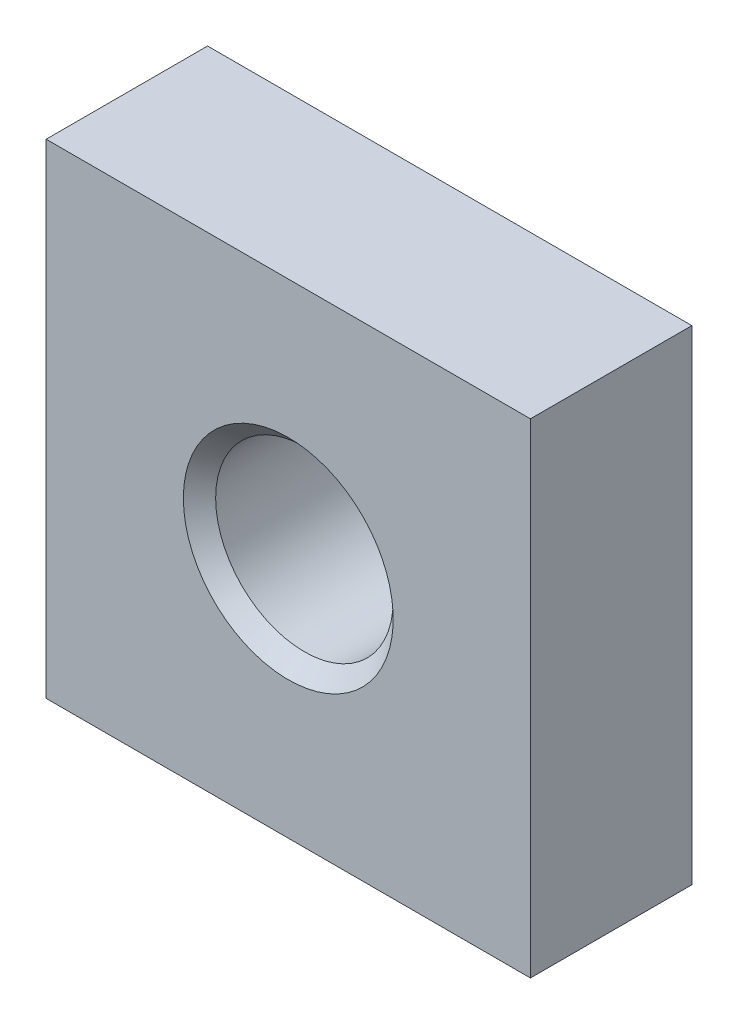
ISO-10303-21;
HEADER;
FILE_DESCRIPTION(('STEP AP214'),'2;1');
FILE_NAME('part.step','',(''),(''),'','','');
FILE_SCHEMA(('AUTOMOTIVE_DESIGN { 1 0 10303 214 1 1 1 1 }'));
ENDSEC;
DATA;
#1=APPLICATION_CONTEXT('core data for automotive mechanical design processes');
#2=APPLICATION_PROTOCOL_DEFINITION('international standard','automotive_design',2000,#1);
#3=PRODUCT_CONTEXT('',#1,'mechanical');
#4=PRODUCT('Part','Part','',(#3));
#5=PRODUCT_RELATED_PRODUCT_CATEGORY('part','',(#4));
#6=PRODUCT_DEFINITION_FORMATION('','',#4);
#7=PRODUCT_DEFINITION_CONTEXT('part definition',#1,'design');
#8=PRODUCT_DEFINITION('design','',#6,#7);
#9=PRODUCT_DEFINITION_SHAPE('','',#8);
#10=(LENGTH_UNIT() NAMED_UNIT(*) SI_UNIT(.MILLI.,.METRE.));
#11=(NAMED_UNIT(*) PLANE_ANGLE_UNIT() SI_UNIT($,.RADIAN.));
#12=(NAMED_UNIT(*) SI_UNIT($,.STERADIAN.) SOLID_ANGLE_UNIT());
#13=UNCERTAINTY_MEASURE_WITH_UNIT(LENGTH_MEASURE(1.E-05),#10,'distance_accuracy_value','');
#14=(GEOMETRIC_REPRESENTATION_CONTEXT(3) GLOBAL_UNCERTAINTY_ASSIGNED_CONTEXT((#13)) GLOBAL_UNIT_ASSIGNED_CONTEXT((#10,
#11,#12)) REPRESENTATION_CONTEXT('',''));
#15=CARTESIAN_POINT('',(0.,0.,0.));
#16=DIRECTION('',(0.,0.,1.));
#17=DIRECTION('',(1.,0.,0.));
#18=AXIS2_PLACEMENT_3D('',#15,#16,#17);
#19=CARTESIAN_POINT('',(0.,0.,-20.));
#20=DIRECTION('',(-1.,0.,0.));
#21=DIRECTION('',(0.,0.,1.));
#22=AXIS2_PLACEMENT_3D('',#19,#20,#21);
#23=PLANE('',#22);
#24=DIRECTION('',(0.,-1.,0.));
#25=VECTOR('',#24,1.);
#26=CARTESIAN_POINT('',(0.,0.,0.));
#27=LINE('',#26,#25);
#28=CARTESIAN_POINT('',(0.,60.,0.));
#29=VERTEX_POINT('',#28);
#30=CARTESIAN_POINT('',(0.,0.,0.));
#31=VERTEX_POINT('',#30);
#32=EDGE_CURVE('E103',#29,#31,#27,.T.);
#33=ORIENTED_EDGE('',*,*,#32,.F.);
#34=DIRECTION('',(0.,0.,1.));
#35=VECTOR('',#34,1.);
#36=CARTESIAN_POINT('',(0.,60.,-20.));
#37=LINE('',#36,#35);
#38=CARTESIAN_POINT('',(0.,60.,-20.));
#39=VERTEX_POINT('',#38);
#40=EDGE_CURVE('E52',#39,#29,#37,.T.);
#41=ORIENTED_EDGE('',*,*,#40,.F.);
#42=DIRECTION('',(0.,-1.,0.));
#43=VECTOR('',#42,1.);
#44=CARTESIAN_POINT('',(0.,0.,-20.));
#45=LINE('',#44,#43);
#46=CARTESIAN_POINT('',(0.,0.,-20.));
#47=VERTEX_POINT('',#46);
#48=EDGE_CURVE('E97',#39,#47,#45,.T.);
#49=ORIENTED_EDGE('',*,*,#48,.T.);
#50=DIRECTION('',(0.,0.,1.));
#51=VECTOR('',#50,1.);
#52=CARTESIAN_POINT('',(0.,0.,-20.));
#53=LINE('',#52,#51);
#54=EDGE_CURVE('E80',#47,#31,#53,.T.);
#55=ORIENTED_EDGE('',*,*,#54,.T.);
#56=EDGE_LOOP('',(#33,#41,#49,#55));
#57=FACE_BOUND('',#56,.T.);
#58=ADVANCED_FACE('F35',(#57),#23,.T.);
#59=CARTESIAN_POINT('',(0.,60.,-20.));
#60=DIRECTION('',(0.,1.,0.));
#61=DIRECTION('',(0.,0.,1.));
#62=AXIS2_PLACEMENT_3D('',#59,#60,#61);
#63=PLANE('',#62);
#64=DIRECTION('',(-1.,0.,0.));
#65=VECTOR('',#64,1.);
#66=CARTESIAN_POINT('',(0.,60.,0.));
#67=LINE('',#66,#65);
#68=CARTESIAN_POINT('',(60.,60.,0.));
#69=VERTEX_POINT('',#68);
#70=EDGE_CURVE('E99',#69,#29,#67,.T.);
#71=ORIENTED_EDGE('',*,*,#70,.F.);
#72=DIRECTION('',(0.,0.,1.));
#73=VECTOR('',#72,1.);
#74=CARTESIAN_POINT('',(60.,60.,-20.));
#75=LINE('',#74,#73);
#76=CARTESIAN_POINT('',(60.,60.,-20.));
#77=VERTEX_POINT('',#76);
#78=EDGE_CURVE('E69',#77,#69,#75,.T.);
#79=ORIENTED_EDGE('',*,*,#78,.F.);
#80=DIRECTION('',(-1.,0.,0.));
#81=VECTOR('',#80,1.);
#82=CARTESIAN_POINT('',(0.,60.,-20.));
#83=LINE('',#82,#81);
#84=EDGE_CURVE('E94',#77,#39,#83,.T.);
#85=ORIENTED_EDGE('',*,*,#84,.T.);
#86=ORIENTED_EDGE('',*,*,#40,.T.);
#87=EDGE_LOOP('',(#71,#79,#85,#86));
#88=FACE_BOUND('',#87,.T.);
#89=ADVANCED_FACE('F149',(#88),#63,.T.);
#90=CARTESIAN_POINT('',(60.,0.,-20.));
#91=DIRECTION('',(1.,0.,0.));
#92=DIRECTION('',(0.,0.,-1.));
#93=AXIS2_PLACEMENT_3D('',#90,#91,#92);
#94=PLANE('',#93);
#95=DIRECTION('',(0.,1.,0.));
#96=VECTOR('',#95,1.);
#97=CARTESIAN_POINT('',(60.,0.,0.));
#98=LINE('',#97,#96);
#99=CARTESIAN_POINT('',(60.,0.,0.));
#100=VERTEX_POINT('',#99);
#101=EDGE_CURVE('E88',#100,#69,#98,.T.);
#102=ORIENTED_EDGE('',*,*,#101,.F.);
#103=DIRECTION('',(0.,0.,1.));
#104=VECTOR('',#103,1.);
#105=CARTESIAN_POINT('',(60.,0.,-20.));
#106=LINE('',#105,#104);
#107=CARTESIAN_POINT('',(60.,0.,-20.));
#108=VERTEX_POINT('',#107);
#109=EDGE_CURVE('E83',#108,#100,#106,.T.);
#110=ORIENTED_EDGE('',*,*,#109,.F.);
#111=DIRECTION('',(0.,1.,0.));
#112=VECTOR('',#111,1.);
#113=CARTESIAN_POINT('',(60.,0.,-20.));
#114=LINE('',#113,#112);
#115=EDGE_CURVE('E86',#108,#77,#114,.T.);
#116=ORIENTED_EDGE('',*,*,#115,.T.);
#117=ORIENTED_EDGE('',*,*,#78,.T.);
#118=EDGE_LOOP('',(#102,#110,#116,#117));
#119=FACE_BOUND('',#118,.T.);
#120=ADVANCED_FACE('F85',(#119),#94,.T.);
#121=CARTESIAN_POINT('',(0.,0.,-20.));
#122=DIRECTION('',(0.,-1.,0.));
#123=DIRECTION('',(0.,0.,-1.));
#124=AXIS2_PLACEMENT_3D('',#121,#122,#123);
#125=PLANE('',#124);
#126=DIRECTION('',(1.,0.,0.));
#127=VECTOR('',#126,1.);
#128=CARTESIAN_POINT('',(0.,0.,0.));
#129=LINE('',#128,#127);
#130=EDGE_CURVE('E106',#31,#100,#129,.T.);
#131=ORIENTED_EDGE('',*,*,#130,.F.);
#132=ORIENTED_EDGE('',*,*,#54,.F.);
#133=DIRECTION('',(1.,0.,0.));
#134=VECTOR('',#133,1.);
#135=CARTESIAN_POINT('',(0.,0.,-20.));
#136=LINE('',#135,#134);
#137=EDGE_CURVE('E93',#47,#108,#136,.T.);
#138=ORIENTED_EDGE('',*,*,#137,.T.);
#139=ORIENTED_EDGE('',*,*,#109,.T.);
#140=EDGE_LOOP('',(#131,#132,#138,#139));
#141=FACE_BOUND('',#140,.T.);
#142=ADVANCED_FACE('F96',(#141),#125,.T.);
#143=CARTESIAN_POINT('',(0.,0.,-20.));
#144=DIRECTION('',(0.,0.,-1.));
#145=DIRECTION('',(-1.,0.,0.));
#146=AXIS2_PLACEMENT_3D('',#143,#144,#145);
#147=PLANE('',#146);
#148=CARTESIAN_POINT('',(30.,30.,-20.));
#149=DIRECTION('',(0.,0.,-1.));
#150=DIRECTION('',(-1.,0.,0.));
#151=AXIS2_PLACEMENT_3D('',#148,#149,#150);
#152=CIRCLE('',#151,13.);
#153=CARTESIAN_POINT('',(17.,30.,-20.));
#154=VERTEX_POINT('',#153);
#155=EDGE_CURVE('E11',#154,#154,#152,.F.);
#156=ORIENTED_EDGE('',*,*,#155,.T.);
#157=EDGE_LOOP('',(#156));
#158=FACE_BOUND('',#157,.T.);
#159=ORIENTED_EDGE('',*,*,#48,.F.);
#160=ORIENTED_EDGE('',*,*,#84,.F.);
#161=ORIENTED_EDGE('',*,*,#115,.F.);
#162=ORIENTED_EDGE('',*,*,#137,.F.);
#163=EDGE_LOOP('',(#159,#160,#161,#162));
#164=FACE_BOUND('',#163,.T.);
#165=ADVANCED_FACE('F92',(#158,#164),#147,.T.);
#166=CARTESIAN_POINT('',(0.,0.,0.));
#167=DIRECTION('',(0.,0.,-1.));
#168=DIRECTION('',(-1.,0.,0.));
#169=AXIS2_PLACEMENT_3D('',#166,#167,#168);
#170=PLANE('',#169);
#171=CARTESIAN_POINT('',(30.,30.,0.));
#172=DIRECTION('',(0.,0.,-1.));
#173=DIRECTION('',(-1.,0.,0.));
#174=AXIS2_PLACEMENT_3D('',#171,#172,#173);
#175=CIRCLE('',#174,13.);
#176=CARTESIAN_POINT('',(17.,30.,0.));
#177=VERTEX_POINT('',#176);
#178=EDGE_CURVE('E44',#177,#177,#175,.T.);
#179=ORIENTED_EDGE('',*,*,#178,.T.);
#180=EDGE_LOOP('',(#179));
#181=FACE_BOUND('',#180,.T.);
#182=ORIENTED_EDGE('',*,*,#32,.T.);
#183=ORIENTED_EDGE('',*,*,#130,.T.);
#184=ORIENTED_EDGE('',*,*,#101,.T.);
#185=ORIENTED_EDGE('',*,*,#70,.T.);
#186=EDGE_LOOP('',(#182,#183,#184,#185));
#187=FACE_BOUND('',#186,.T.);
#188=ADVANCED_FACE('F122',(#181,#187),#170,.F.);
#189=CARTESIAN_POINT('',(30.,30.,-20.));
#190=DIRECTION('',(0.,0.,1.));
#191=DIRECTION('',(1.,0.,0.));
#192=AXIS2_PLACEMENT_3D('',#189,#190,#191);
#193=CYLINDRICAL_SURFACE('',#192,11.);
#194=CARTESIAN_POINT('',(30.,30.,-2.00000000000001));
#195=DIRECTION('',(0.,0.,-1.));
#196=DIRECTION('',(-1.,0.,0.));
#197=AXIS2_PLACEMENT_3D('',#194,#195,#196);
#198=CIRCLE('',#197,11.);
#199=CARTESIAN_POINT('',(19.,30.,-2.00000000000001));
#200=VERTEX_POINT('',#199);
#201=EDGE_CURVE('E117',#200,#200,#198,.F.);
#202=ORIENTED_EDGE('',*,*,#201,.T.);
#203=EDGE_LOOP('',(#202));
#204=FACE_BOUND('',#203,.T.);
#205=CARTESIAN_POINT('',(30.,30.,-18.));
#206=DIRECTION('',(0.,0.,-1.));
#207=DIRECTION('',(-1.,0.,0.));
#208=AXIS2_PLACEMENT_3D('',#205,#206,#207);
#209=CIRCLE('',#208,11.);
#210=CARTESIAN_POINT('',(19.,30.,-18.));
#211=VERTEX_POINT('',#210);
#212=EDGE_CURVE('E112',#211,#211,#209,.T.);
#213=ORIENTED_EDGE('',*,*,#212,.T.);
#214=EDGE_LOOP('',(#213));
#215=FACE_BOUND('',#214,.T.);
#216=ADVANCED_FACE('F128',(#204,#215),#193,.F.);
#217=CARTESIAN_POINT('',(30.,30.,-2.00000000000001));
#218=DIRECTION('',(0.,0.,1.));
#219=DIRECTION('',(1.,0.,0.));
#220=AXIS2_PLACEMENT_3D('',#217,#218,#219);
#221=CONICAL_SURFACE('',#220,11.,0.785398163397451);
#222=ORIENTED_EDGE('',*,*,#178,.F.);
#223=EDGE_LOOP('',(#222));
#224=FACE_BOUND('',#223,.T.);
#225=ORIENTED_EDGE('',*,*,#201,.F.);
#226=EDGE_LOOP('',(#225));
#227=FACE_BOUND('',#226,.T.);
#228=ADVANCED_FACE('F125',(#224,#227),#221,.F.);
#229=CARTESIAN_POINT('',(30.,30.,-20.));
#230=DIRECTION('',(0.,0.,-1.));
#231=DIRECTION('',(-1.,0.,0.));
#232=AXIS2_PLACEMENT_3D('',#229,#230,#231);
#233=CONICAL_SURFACE('',#232,13.,0.785398163397449);
#234=ORIENTED_EDGE('',*,*,#212,.F.);
#235=EDGE_LOOP('',(#234));
#236=FACE_BOUND('',#235,.T.);
#237=ORIENTED_EDGE('',*,*,#155,.F.);
#238=EDGE_LOOP('',(#237));
#239=FACE_BOUND('',#238,.T.);
#240=ADVANCED_FACE('F37',(#236,#239),#233,.F.);
#241=CLOSED_SHELL('',(#58,#89,#120,#142,#165,#188,#216,#228,#240));
#242=MANIFOLD_SOLID_BREP('B2',#241);
#243=ADVANCED_BREP_SHAPE_REPRESENTATION('',(#18,#242),#14);
#244=SHAPE_DEFINITION_REPRESENTATION(#9,#243);
ENDSEC;
END-ISO-10303-21;
